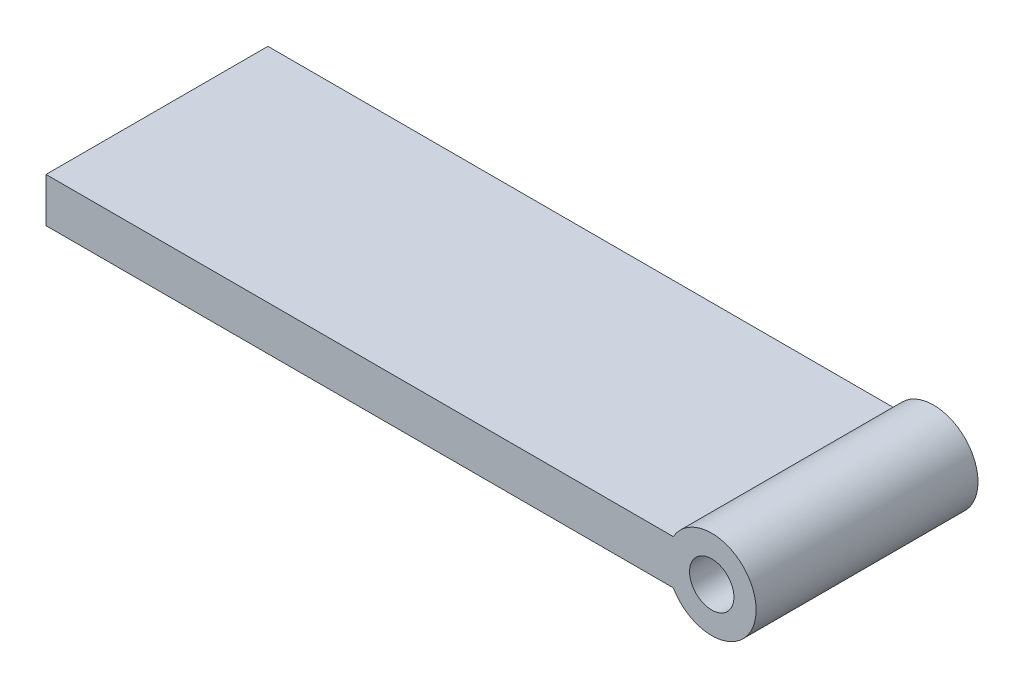
ISO-10303-21;
HEADER;
FILE_DESCRIPTION(('STEP AP214'),'2;1');
FILE_NAME('part.step','',(''),(''),'','','');
FILE_SCHEMA(('AUTOMOTIVE_DESIGN { 1 0 10303 214 1 1 1 1 }'));
ENDSEC;
DATA;
#1=APPLICATION_CONTEXT('core data for automotive mechanical design processes');
#2=APPLICATION_PROTOCOL_DEFINITION('international standard','automotive_design',2000,#1);
#3=PRODUCT_CONTEXT('',#1,'mechanical');
#4=PRODUCT('Part','Part','',(#3));
#5=PRODUCT_RELATED_PRODUCT_CATEGORY('part','',(#4));
#6=PRODUCT_DEFINITION_FORMATION('','',#4);
#7=PRODUCT_DEFINITION_CONTEXT('part definition',#1,'design');
#8=PRODUCT_DEFINITION('design','',#6,#7);
#9=PRODUCT_DEFINITION_SHAPE('','',#8);
#10=(LENGTH_UNIT() NAMED_UNIT(*) SI_UNIT(.MILLI.,.METRE.));
#11=(NAMED_UNIT(*) PLANE_ANGLE_UNIT() SI_UNIT($,.RADIAN.));
#12=(NAMED_UNIT(*) SI_UNIT($,.STERADIAN.) SOLID_ANGLE_UNIT());
#13=UNCERTAINTY_MEASURE_WITH_UNIT(LENGTH_MEASURE(1.E-05),#10,'distance_accuracy_value','');
#14=(GEOMETRIC_REPRESENTATION_CONTEXT(3) GLOBAL_UNCERTAINTY_ASSIGNED_CONTEXT((#13)) GLOBAL_UNIT_ASSIGNED_CONTEXT((#10,
#11,#12)) REPRESENTATION_CONTEXT('',''));
#15=CARTESIAN_POINT('',(0.,0.,0.));
#16=DIRECTION('',(0.,0.,1.));
#17=DIRECTION('',(1.,0.,0.));
#18=AXIS2_PLACEMENT_3D('',#15,#16,#17);
#19=CARTESIAN_POINT('',(0.,10.,-50.));
#20=DIRECTION('',(0.,0.,1.));
#21=DIRECTION('',(1.,0.,0.));
#22=AXIS2_PLACEMENT_3D('',#19,#20,#21);
#23=PLANE('',#22);
#24=CARTESIAN_POINT('',(0.,5.,-50.));
#25=DIRECTION('',(0.,0.,1.));
#26=DIRECTION('',(1.,0.,0.));
#27=AXIS2_PLACEMENT_3D('',#24,#25,#26);
#28=CIRCLE('',#27,5.);
#29=CARTESIAN_POINT('',(5.,5.,-50.));
#30=VERTEX_POINT('',#29);
#31=EDGE_CURVE('E90',#30,#30,#28,.T.);
#32=ORIENTED_EDGE('',*,*,#31,.T.);
#33=EDGE_LOOP('',(#32));
#34=FACE_BOUND('',#33,.T.);
#35=DIRECTION('',(-1.,0.,0.));
#36=VECTOR('',#35,1.);
#37=CARTESIAN_POINT('',(0.,10.,-50.));
#38=LINE('',#37,#36);
#39=CARTESIAN_POINT('',(-8.66025403784439,10.,-50.));
#40=VERTEX_POINT('',#39);
#41=CARTESIAN_POINT('',(-150.,10.,-50.));
#42=VERTEX_POINT('',#41);
#43=EDGE_CURVE('E96',#40,#42,#38,.T.);
#44=ORIENTED_EDGE('',*,*,#43,.F.);
#45=CARTESIAN_POINT('',(0.,5.,-50.));
#46=DIRECTION('',(0.,0.,1.));
#47=DIRECTION('',(1.,0.,0.));
#48=AXIS2_PLACEMENT_3D('',#45,#46,#47);
#49=CIRCLE('',#48,10.);
#50=CARTESIAN_POINT('',(-8.66025403784439,0.,-50.));
#51=VERTEX_POINT('',#50);
#52=EDGE_CURVE('E79',#51,#40,#49,.T.);
#53=ORIENTED_EDGE('',*,*,#52,.F.);
#54=DIRECTION('',(-1.,0.,0.));
#55=VECTOR('',#54,1.);
#56=CARTESIAN_POINT('',(0.,0.,-50.));
#57=LINE('',#56,#55);
#58=CARTESIAN_POINT('',(-150.,0.,-50.));
#59=VERTEX_POINT('',#58);
#60=EDGE_CURVE('E60',#51,#59,#57,.T.);
#61=ORIENTED_EDGE('',*,*,#60,.T.);
#62=DIRECTION('',(0.,-1.,0.));
#63=VECTOR('',#62,1.);
#64=CARTESIAN_POINT('',(-150.,10.,-50.));
#65=LINE('',#64,#63);
#66=EDGE_CURVE('E41',#42,#59,#65,.T.);
#67=ORIENTED_EDGE('',*,*,#66,.F.);
#68=EDGE_LOOP('',(#44,#53,#61,#67));
#69=FACE_BOUND('',#68,.T.);
#70=ADVANCED_FACE('F33',(#34,#69),#23,.F.);
#71=CARTESIAN_POINT('',(-150.,10.,0.));
#72=DIRECTION('',(1.,0.,0.));
#73=DIRECTION('',(0.,0.,-1.));
#74=AXIS2_PLACEMENT_3D('',#71,#72,#73);
#75=PLANE('',#74);
#76=DIRECTION('',(0.,0.,1.));
#77=VECTOR('',#76,1.);
#78=CARTESIAN_POINT('',(-150.,0.,0.));
#79=LINE('',#78,#77);
#80=CARTESIAN_POINT('',(-150.,0.,0.));
#81=VERTEX_POINT('',#80);
#82=EDGE_CURVE('E101',#59,#81,#79,.T.);
#83=ORIENTED_EDGE('',*,*,#82,.T.);
#84=DIRECTION('',(0.,-1.,0.));
#85=VECTOR('',#84,1.);
#86=CARTESIAN_POINT('',(-150.,10.,0.));
#87=LINE('',#86,#85);
#88=CARTESIAN_POINT('',(-150.,10.,0.));
#89=VERTEX_POINT('',#88);
#90=EDGE_CURVE('E93',#89,#81,#87,.T.);
#91=ORIENTED_EDGE('',*,*,#90,.F.);
#92=DIRECTION('',(0.,0.,1.));
#93=VECTOR('',#92,1.);
#94=CARTESIAN_POINT('',(-150.,10.,0.));
#95=LINE('',#94,#93);
#96=EDGE_CURVE('E49',#42,#89,#95,.T.);
#97=ORIENTED_EDGE('',*,*,#96,.F.);
#98=ORIENTED_EDGE('',*,*,#66,.T.);
#99=EDGE_LOOP('',(#83,#91,#97,#98));
#100=FACE_BOUND('',#99,.T.);
#101=ADVANCED_FACE('F105',(#100),#75,.F.);
#102=CARTESIAN_POINT('',(0.,10.,0.));
#103=DIRECTION('',(0.,0.,-1.));
#104=DIRECTION('',(-1.,0.,0.));
#105=AXIS2_PLACEMENT_3D('',#102,#103,#104);
#106=PLANE('',#105);
#107=CARTESIAN_POINT('',(0.,5.,0.));
#108=DIRECTION('',(0.,0.,1.));
#109=DIRECTION('',(1.,0.,0.));
#110=AXIS2_PLACEMENT_3D('',#107,#108,#109);
#111=CIRCLE('',#110,5.);
#112=CARTESIAN_POINT('',(5.,5.,0.));
#113=VERTEX_POINT('',#112);
#114=EDGE_CURVE('E127',#113,#113,#111,.T.);
#115=ORIENTED_EDGE('',*,*,#114,.F.);
#116=EDGE_LOOP('',(#115));
#117=FACE_BOUND('',#116,.T.);
#118=DIRECTION('',(1.,0.,0.));
#119=VECTOR('',#118,1.);
#120=CARTESIAN_POINT('',(0.,0.,0.));
#121=LINE('',#120,#119);
#122=CARTESIAN_POINT('',(-8.66025403784439,0.,0.));
#123=VERTEX_POINT('',#122);
#124=EDGE_CURVE('E89',#81,#123,#121,.T.);
#125=ORIENTED_EDGE('',*,*,#124,.T.);
#126=CARTESIAN_POINT('',(0.,5.,0.));
#127=DIRECTION('',(0.,0.,1.));
#128=DIRECTION('',(1.,0.,0.));
#129=AXIS2_PLACEMENT_3D('',#126,#127,#128);
#130=CIRCLE('',#129,10.);
#131=CARTESIAN_POINT('',(-8.66025403784439,10.,0.));
#132=VERTEX_POINT('',#131);
#133=EDGE_CURVE('E78',#123,#132,#130,.T.);
#134=ORIENTED_EDGE('',*,*,#133,.T.);
#135=DIRECTION('',(1.,0.,0.));
#136=VECTOR('',#135,1.);
#137=CARTESIAN_POINT('',(0.,10.,0.));
#138=LINE('',#137,#136);
#139=EDGE_CURVE('E87',#89,#132,#138,.T.);
#140=ORIENTED_EDGE('',*,*,#139,.F.);
#141=ORIENTED_EDGE('',*,*,#90,.T.);
#142=EDGE_LOOP('',(#125,#134,#140,#141));
#143=FACE_BOUND('',#142,.T.);
#144=ADVANCED_FACE('F85',(#117,#143),#106,.F.);
#145=CARTESIAN_POINT('',(0.,10.,0.));
#146=DIRECTION('',(0.,1.,0.));
#147=DIRECTION('',(0.,0.,1.));
#148=AXIS2_PLACEMENT_3D('',#145,#146,#147);
#149=PLANE('',#148);
#150=DIRECTION('',(0.,0.,1.));
#151=VECTOR('',#150,1.);
#152=CARTESIAN_POINT('',(-8.66025403784439,10.,-50.));
#153=LINE('',#152,#151);
#154=EDGE_CURVE('E75',#40,#132,#153,.T.);
#155=ORIENTED_EDGE('',*,*,#154,.F.);
#156=ORIENTED_EDGE('',*,*,#43,.T.);
#157=ORIENTED_EDGE('',*,*,#96,.T.);
#158=ORIENTED_EDGE('',*,*,#139,.T.);
#159=EDGE_LOOP('',(#155,#156,#157,#158));
#160=FACE_BOUND('',#159,.T.);
#161=ADVANCED_FACE('F92',(#160),#149,.T.);
#162=CARTESIAN_POINT('',(0.,0.,0.));
#163=DIRECTION('',(0.,1.,0.));
#164=DIRECTION('',(0.,0.,1.));
#165=AXIS2_PLACEMENT_3D('',#162,#163,#164);
#166=PLANE('',#165);
#167=ORIENTED_EDGE('',*,*,#60,.F.);
#168=DIRECTION('',(0.,0.,1.));
#169=VECTOR('',#168,1.);
#170=CARTESIAN_POINT('',(-8.66025403784439,0.,-50.));
#171=LINE('',#170,#169);
#172=EDGE_CURVE('E11',#51,#123,#171,.T.);
#173=ORIENTED_EDGE('',*,*,#172,.T.);
#174=ORIENTED_EDGE('',*,*,#124,.F.);
#175=ORIENTED_EDGE('',*,*,#82,.F.);
#176=EDGE_LOOP('',(#167,#173,#174,#175));
#177=FACE_BOUND('',#176,.T.);
#178=ADVANCED_FACE('F107',(#177),#166,.F.);
#179=CARTESIAN_POINT('',(0.,5.,-50.));
#180=DIRECTION('',(0.,0.,1.));
#181=DIRECTION('',(1.,0.,0.));
#182=AXIS2_PLACEMENT_3D('',#179,#180,#181);
#183=CYLINDRICAL_SURFACE('',#182,10.);
#184=ORIENTED_EDGE('',*,*,#52,.T.);
#185=ORIENTED_EDGE('',*,*,#154,.T.);
#186=ORIENTED_EDGE('',*,*,#133,.F.);
#187=ORIENTED_EDGE('',*,*,#172,.F.);
#188=EDGE_LOOP('',(#184,#185,#186,#187));
#189=FACE_BOUND('',#188,.T.);
#190=ADVANCED_FACE('F77',(#189),#183,.T.);
#191=CARTESIAN_POINT('',(0.,5.,-50.));
#192=DIRECTION('',(0.,0.,1.));
#193=DIRECTION('',(1.,0.,0.));
#194=AXIS2_PLACEMENT_3D('',#191,#192,#193);
#195=CYLINDRICAL_SURFACE('',#194,5.);
#196=ORIENTED_EDGE('',*,*,#31,.F.);
#197=EDGE_LOOP('',(#196));
#198=FACE_BOUND('',#197,.T.);
#199=ORIENTED_EDGE('',*,*,#114,.T.);
#200=EDGE_LOOP('',(#199));
#201=FACE_BOUND('',#200,.T.);
#202=ADVANCED_FACE('F114',(#198,#201),#195,.F.);
#203=CLOSED_SHELL('',(#70,#101,#144,#161,#178,#190,#202));
#204=MANIFOLD_SOLID_BREP('B2',#203);
#205=ADVANCED_BREP_SHAPE_REPRESENTATION('',(#18,#204),#14);
#206=SHAPE_DEFINITION_REPRESENTATION(#9,#205);
ENDSEC;
END-ISO-10303-21;
